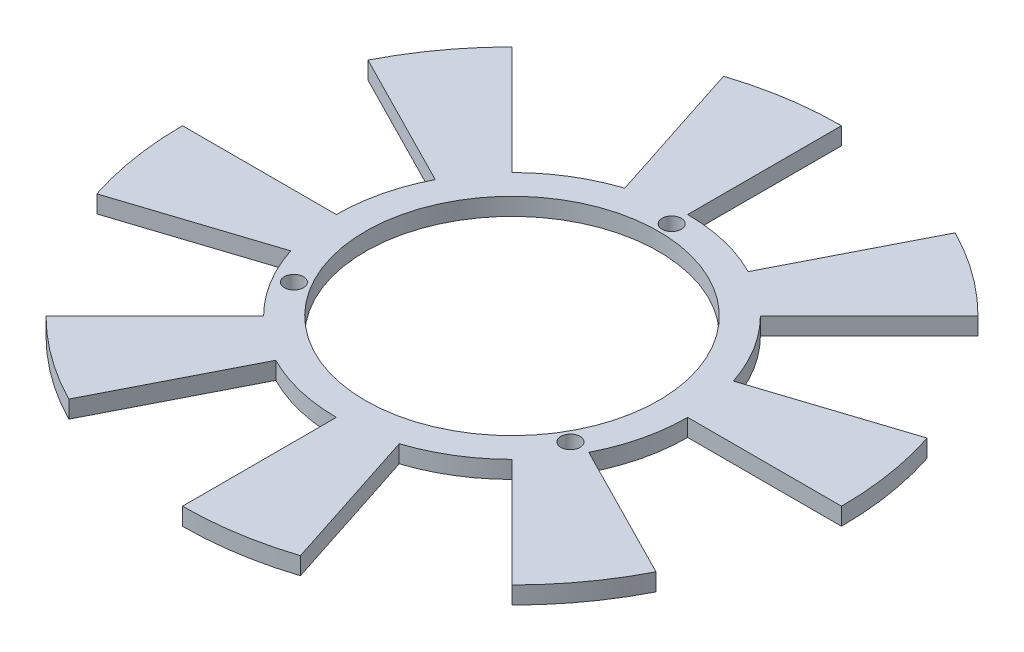
ISO-10303-21;
HEADER;
FILE_DESCRIPTION(('STEP AP214'),'2;1');
FILE_NAME('part.step','',(''),(''),'','','');
FILE_SCHEMA(('AUTOMOTIVE_DESIGN { 1 0 10303 214 1 1 1 1 }'));
ENDSEC;
DATA;
#1=APPLICATION_CONTEXT('core data for automotive mechanical design processes');
#2=APPLICATION_PROTOCOL_DEFINITION('international standard','automotive_design',2000,#1);
#3=PRODUCT_CONTEXT('',#1,'mechanical');
#4=PRODUCT('Part','Part','',(#3));
#5=PRODUCT_RELATED_PRODUCT_CATEGORY('part','',(#4));
#6=PRODUCT_DEFINITION_FORMATION('','',#4);
#7=PRODUCT_DEFINITION_CONTEXT('part definition',#1,'design');
#8=PRODUCT_DEFINITION('design','',#6,#7);
#9=PRODUCT_DEFINITION_SHAPE('','',#8);
#10=(LENGTH_UNIT() NAMED_UNIT(*) SI_UNIT(.MILLI.,.METRE.));
#11=(NAMED_UNIT(*) PLANE_ANGLE_UNIT() SI_UNIT($,.RADIAN.));
#12=(NAMED_UNIT(*) SI_UNIT($,.STERADIAN.) SOLID_ANGLE_UNIT());
#13=UNCERTAINTY_MEASURE_WITH_UNIT(LENGTH_MEASURE(1.E-05),#10,'distance_accuracy_value','');
#14=(GEOMETRIC_REPRESENTATION_CONTEXT(3) GLOBAL_UNCERTAINTY_ASSIGNED_CONTEXT((#13)) GLOBAL_UNIT_ASSIGNED_CONTEXT((#10,
#11,#12)) REPRESENTATION_CONTEXT('',''));
#15=CARTESIAN_POINT('',(0.,0.,0.));
#16=DIRECTION('',(0.,0.,1.));
#17=DIRECTION('',(1.,0.,0.));
#18=AXIS2_PLACEMENT_3D('',#15,#16,#17);
#19=CARTESIAN_POINT('',(0.,-3.,0.));
#20=DIRECTION('',(0.,1.,0.));
#21=DIRECTION('',(0.,0.,1.));
#22=AXIS2_PLACEMENT_3D('',#19,#20,#21);
#23=CYLINDRICAL_SURFACE('',#22,30.25);
#24=DIRECTION('',(0.,-1.,0.));
#25=VECTOR('',#24,1.);
#26=CARTESIAN_POINT('',(-13.7332126171213,0.,26.9529473566981));
#27=LINE('',#26,#25);
#28=CARTESIAN_POINT('',(-13.7332126171213,0.,26.9529473566981));
#29=VERTEX_POINT('',#28);
#30=CARTESIAN_POINT('',(-13.7332126171213,-3.,26.9529473566981));
#31=VERTEX_POINT('',#30);
#32=EDGE_CURVE('E285',#29,#31,#27,.T.);
#33=ORIENTED_EDGE('',*,*,#32,.T.);
#34=CARTESIAN_POINT('',(0.,-3.,0.));
#35=DIRECTION('',(0.,1.,0.));
#36=DIRECTION('',(1.,0.,0.));
#37=AXIS2_PLACEMENT_3D('',#34,#35,#36);
#38=CIRCLE('',#37,30.25);
#39=CARTESIAN_POINT('',(0.,-3.,30.25));
#40=VERTEX_POINT('',#39);
#41=EDGE_CURVE('E50',#31,#40,#38,.T.);
#42=ORIENTED_EDGE('',*,*,#41,.T.);
#43=DIRECTION('',(0.,-1.,0.));
#44=VECTOR('',#43,1.);
#45=CARTESIAN_POINT('',(0.,0.,30.25));
#46=LINE('',#45,#44);
#47=CARTESIAN_POINT('',(0.,0.,30.25));
#48=VERTEX_POINT('',#47);
#49=EDGE_CURVE('E441',#48,#40,#46,.T.);
#50=ORIENTED_EDGE('',*,*,#49,.F.);
#51=CARTESIAN_POINT('',(0.,0.,0.));
#52=DIRECTION('',(0.,1.,0.));
#53=DIRECTION('',(1.,0.,0.));
#54=AXIS2_PLACEMENT_3D('',#51,#52,#53);
#55=CIRCLE('',#54,30.25);
#56=EDGE_CURVE('E540',#29,#48,#55,.T.);
#57=ORIENTED_EDGE('',*,*,#56,.F.);
#58=EDGE_LOOP('',(#33,#42,#50,#57));
#59=FACE_BOUND('',#58,.T.);
#60=ADVANCED_FACE('F40',(#59),#23,.T.);
#61=DIRECTION('',(0.,-1.,0.));
#62=VECTOR('',#61,1.);
#63=CARTESIAN_POINT('',(-21.3899801308925,0.,21.3899801308936));
#64=LINE('',#63,#62);
#65=CARTESIAN_POINT('',(-21.3899801308925,0.,21.3899801308936));
#66=VERTEX_POINT('',#65);
#67=CARTESIAN_POINT('',(-21.3899801308925,-3.,21.3899801308936));
#68=VERTEX_POINT('',#67);
#69=EDGE_CURVE('E264',#66,#68,#64,.T.);
#70=ORIENTED_EDGE('',*,*,#69,.F.);
#71=CARTESIAN_POINT('',(-28.7694596179284,0.,9.34776407984219));
#72=VERTEX_POINT('',#71);
#73=EDGE_CURVE('E270',#72,#66,#55,.T.);
#74=ORIENTED_EDGE('',*,*,#73,.F.);
#75=DIRECTION('',(0.,-1.,0.));
#76=VECTOR('',#75,1.);
#77=CARTESIAN_POINT('',(-28.7694596179284,0.,9.34776407984219));
#78=LINE('',#77,#76);
#79=CARTESIAN_POINT('',(-28.7694596179284,-3.,9.34776407984219));
#80=VERTEX_POINT('',#79);
#81=EDGE_CURVE('E307',#72,#80,#78,.T.);
#82=ORIENTED_EDGE('',*,*,#81,.T.);
#83=EDGE_CURVE('E611',#80,#68,#38,.T.);
#84=ORIENTED_EDGE('',*,*,#83,.T.);
#85=EDGE_LOOP('',(#70,#74,#82,#84));
#86=FACE_BOUND('',#85,.T.);
#87=ADVANCED_FACE('F515',(#86),#23,.T.);
#88=DIRECTION('',(0.,-1.,0.));
#89=VECTOR('',#88,1.);
#90=CARTESIAN_POINT('',(-30.25,0.,7.49400541621981E-13));
#91=LINE('',#90,#89);
#92=CARTESIAN_POINT('',(-30.25,0.,7.49400541621981E-13));
#93=VERTEX_POINT('',#92);
#94=CARTESIAN_POINT('',(-30.25,-3.,7.49400541621981E-13));
#95=VERTEX_POINT('',#94);
#96=EDGE_CURVE('E310',#93,#95,#91,.T.);
#97=ORIENTED_EDGE('',*,*,#96,.F.);
#98=CARTESIAN_POINT('',(-26.9529473566981,0.,-13.7332126171213));
#99=VERTEX_POINT('',#98);
#100=EDGE_CURVE('E588',#99,#93,#55,.T.);
#101=ORIENTED_EDGE('',*,*,#100,.F.);
#102=DIRECTION('',(0.,-1.,0.));
#103=VECTOR('',#102,1.);
#104=CARTESIAN_POINT('',(-26.9529473566981,0.,-13.7332126171213));
#105=LINE('',#104,#103);
#106=CARTESIAN_POINT('',(-26.9529473566981,-3.,-13.7332126171213));
#107=VERTEX_POINT('',#106);
#108=EDGE_CURVE('E333',#99,#107,#105,.T.);
#109=ORIENTED_EDGE('',*,*,#108,.T.);
#110=EDGE_CURVE('E600',#107,#95,#38,.T.);
#111=ORIENTED_EDGE('',*,*,#110,.T.);
#112=EDGE_LOOP('',(#97,#101,#109,#111));
#113=FACE_BOUND('',#112,.T.);
#114=ADVANCED_FACE('F520',(#113),#23,.T.);
#115=DIRECTION('',(0.,-1.,0.));
#116=VECTOR('',#115,1.);
#117=CARTESIAN_POINT('',(-21.3899801308936,0.,-21.3899801308926));
#118=LINE('',#117,#116);
#119=CARTESIAN_POINT('',(-21.3899801308936,0.,-21.3899801308926));
#120=VERTEX_POINT('',#119);
#121=CARTESIAN_POINT('',(-21.3899801308936,-3.,-21.3899801308926));
#122=VERTEX_POINT('',#121);
#123=EDGE_CURVE('E336',#120,#122,#118,.T.);
#124=ORIENTED_EDGE('',*,*,#123,.F.);
#125=CARTESIAN_POINT('',(-9.34776407984219,0.,-28.7694596179284));
#126=VERTEX_POINT('',#125);
#127=EDGE_CURVE('E586',#126,#120,#55,.T.);
#128=ORIENTED_EDGE('',*,*,#127,.F.);
#129=DIRECTION('',(0.,-1.,0.));
#130=VECTOR('',#129,1.);
#131=CARTESIAN_POINT('',(-9.34776407984219,0.,-28.7694596179284));
#132=LINE('',#131,#130);
#133=CARTESIAN_POINT('',(-9.34776407984219,-3.,-28.7694596179284));
#134=VERTEX_POINT('',#133);
#135=EDGE_CURVE('E359',#126,#134,#132,.T.);
#136=ORIENTED_EDGE('',*,*,#135,.T.);
#137=EDGE_CURVE('E864',#134,#122,#38,.T.);
#138=ORIENTED_EDGE('',*,*,#137,.T.);
#139=EDGE_LOOP('',(#124,#128,#136,#138));
#140=FACE_BOUND('',#139,.T.);
#141=ADVANCED_FACE('F863',(#140),#23,.T.);
#142=DIRECTION('',(0.,-1.,0.));
#143=VECTOR('',#142,1.);
#144=CARTESIAN_POINT('',(-6.27102536565616E-13,0.,-30.25));
#145=LINE('',#144,#143);
#146=CARTESIAN_POINT('',(-6.27102536565616E-13,0.,-30.25));
#147=VERTEX_POINT('',#146);
#148=CARTESIAN_POINT('',(-6.27102536565616E-13,-3.,-30.25));
#149=VERTEX_POINT('',#148);
#150=EDGE_CURVE('E362',#147,#149,#145,.T.);
#151=ORIENTED_EDGE('',*,*,#150,.F.);
#152=CARTESIAN_POINT('',(13.7332126171213,0.,-26.9529473566981));
#153=VERTEX_POINT('',#152);
#154=EDGE_CURVE('E542',#153,#147,#55,.T.);
#155=ORIENTED_EDGE('',*,*,#154,.F.);
#156=DIRECTION('',(0.,-1.,0.));
#157=VECTOR('',#156,1.);
#158=CARTESIAN_POINT('',(13.7332126171213,0.,-26.9529473566981));
#159=LINE('',#158,#157);
#160=CARTESIAN_POINT('',(13.7332126171213,-3.,-26.9529473566981));
#161=VERTEX_POINT('',#160);
#162=EDGE_CURVE('E385',#153,#161,#159,.T.);
#163=ORIENTED_EDGE('',*,*,#162,.T.);
#164=EDGE_CURVE('E866',#161,#149,#38,.T.);
#165=ORIENTED_EDGE('',*,*,#164,.T.);
#166=EDGE_LOOP('',(#151,#155,#163,#165));
#167=FACE_BOUND('',#166,.T.);
#168=ADVANCED_FACE('F871',(#167),#23,.T.);
#169=DIRECTION('',(0.,-1.,0.));
#170=VECTOR('',#169,1.);
#171=CARTESIAN_POINT('',(21.3899801308927,0.,-21.3899801308935));
#172=LINE('',#171,#170);
#173=CARTESIAN_POINT('',(21.3899801308927,0.,-21.3899801308935));
#174=VERTEX_POINT('',#173);
#175=CARTESIAN_POINT('',(21.3899801308927,-3.,-21.3899801308935));
#176=VERTEX_POINT('',#175);
#177=EDGE_CURVE('E388',#174,#176,#172,.T.);
#178=ORIENTED_EDGE('',*,*,#177,.F.);
#179=CARTESIAN_POINT('',(28.7694596179284,0.,-9.34776407984219));
#180=VERTEX_POINT('',#179);
#181=EDGE_CURVE('E539',#180,#174,#55,.T.);
#182=ORIENTED_EDGE('',*,*,#181,.F.);
#183=DIRECTION('',(0.,-1.,0.));
#184=VECTOR('',#183,1.);
#185=CARTESIAN_POINT('',(28.7694596179284,0.,-9.34776407984219));
#186=LINE('',#185,#184);
#187=CARTESIAN_POINT('',(28.7694596179284,-3.,-9.34776407984219));
#188=VERTEX_POINT('',#187);
#189=EDGE_CURVE('E411',#180,#188,#186,.T.);
#190=ORIENTED_EDGE('',*,*,#189,.T.);
#191=EDGE_CURVE('E49',#188,#176,#38,.T.);
#192=ORIENTED_EDGE('',*,*,#191,.T.);
#193=EDGE_LOOP('',(#178,#182,#190,#192));
#194=FACE_BOUND('',#193,.T.);
#195=ADVANCED_FACE('F528',(#194),#23,.T.);
#196=DIRECTION('',(0.,-1.,0.));
#197=VECTOR('',#196,1.);
#198=CARTESIAN_POINT('',(9.34776407984219,0.,28.7694596179284));
#199=LINE('',#198,#197);
#200=CARTESIAN_POINT('',(9.34776407984219,0.,28.7694596179284));
#201=VERTEX_POINT('',#200);
#202=CARTESIAN_POINT('',(9.34776407984219,-3.,28.7694596179284));
#203=VERTEX_POINT('',#202);
#204=EDGE_CURVE('E438',#201,#203,#199,.T.);
#205=ORIENTED_EDGE('',*,*,#204,.T.);
#206=CARTESIAN_POINT('',(21.3899801308934,-3.,21.3899801308927));
#207=VERTEX_POINT('',#206);
#208=EDGE_CURVE('E51',#203,#207,#38,.T.);
#209=ORIENTED_EDGE('',*,*,#208,.T.);
#210=DIRECTION('',(0.,-1.,0.));
#211=VECTOR('',#210,1.);
#212=CARTESIAN_POINT('',(21.3899801308934,0.,21.3899801308927));
#213=LINE('',#212,#211);
#214=CARTESIAN_POINT('',(21.3899801308934,0.,21.3899801308927));
#215=VERTEX_POINT('',#214);
#216=EDGE_CURVE('E469',#215,#207,#213,.T.);
#217=ORIENTED_EDGE('',*,*,#216,.F.);
#218=EDGE_CURVE('E494',#201,#215,#55,.T.);
#219=ORIENTED_EDGE('',*,*,#218,.F.);
#220=EDGE_LOOP('',(#205,#209,#217,#219));
#221=FACE_BOUND('',#220,.T.);
#222=ADVANCED_FACE('F523',(#221),#23,.T.);
#223=DIRECTION('',(0.,-1.,0.));
#224=VECTOR('',#223,1.);
#225=CARTESIAN_POINT('',(30.25,0.,-5.29090660172926E-13));
#226=LINE('',#225,#224);
#227=CARTESIAN_POINT('',(30.25,0.,-5.29090660172926E-13));
#228=VERTEX_POINT('',#227);
#229=CARTESIAN_POINT('',(30.25,-3.,-5.29090660172926E-13));
#230=VERTEX_POINT('',#229);
#231=EDGE_CURVE('E414',#228,#230,#226,.T.);
#232=ORIENTED_EDGE('',*,*,#231,.F.);
#233=CARTESIAN_POINT('',(26.9529473566981,0.,13.7332126171213));
#234=VERTEX_POINT('',#233);
#235=EDGE_CURVE('E44',#234,#228,#55,.T.);
#236=ORIENTED_EDGE('',*,*,#235,.F.);
#237=DIRECTION('',(0.,-1.,0.));
#238=VECTOR('',#237,1.);
#239=CARTESIAN_POINT('',(26.9529473566981,0.,13.7332126171213));
#240=LINE('',#239,#238);
#241=CARTESIAN_POINT('',(26.9529473566981,-3.,13.7332126171213));
#242=VERTEX_POINT('',#241);
#243=EDGE_CURVE('E466',#234,#242,#240,.T.);
#244=ORIENTED_EDGE('',*,*,#243,.T.);
#245=EDGE_CURVE('E12',#242,#230,#38,.T.);
#246=ORIENTED_EDGE('',*,*,#245,.T.);
#247=EDGE_LOOP('',(#232,#236,#244,#246));
#248=FACE_BOUND('',#247,.T.);
#249=ADVANCED_FACE('F42',(#248),#23,.T.);
#250=CARTESIAN_POINT('',(0.,-3.,0.));
#251=DIRECTION('',(0.,1.,0.));
#252=DIRECTION('',(0.,0.,1.));
#253=AXIS2_PLACEMENT_3D('',#250,#251,#252);
#254=PLANE('',#253);
#255=CARTESIAN_POINT('',(0.,-3.,-27.5));
#256=DIRECTION('',(0.,1.,0.));
#257=DIRECTION('',(0.,0.,1.));
#258=AXIS2_PLACEMENT_3D('',#255,#256,#257);
#259=CIRCLE('',#258,1.65);
#260=CARTESIAN_POINT('',(0.,-3.,-25.85));
#261=VERTEX_POINT('',#260);
#262=EDGE_CURVE('E487',#261,#261,#259,.T.);
#263=ORIENTED_EDGE('',*,*,#262,.T.);
#264=EDGE_LOOP('',(#263));
#265=FACE_BOUND('',#264,.T.);
#266=CARTESIAN_POINT('',(23.815698604072,-3.,13.7500000000001));
#267=DIRECTION('',(0.,1.,0.));
#268=DIRECTION('',(0.,0.,1.));
#269=AXIS2_PLACEMENT_3D('',#266,#267,#268);
#270=CIRCLE('',#269,1.65);
#271=CARTESIAN_POINT('',(23.815698604072,-3.,15.4000000000001));
#272=VERTEX_POINT('',#271);
#273=EDGE_CURVE('E484',#272,#272,#270,.T.);
#274=ORIENTED_EDGE('',*,*,#273,.T.);
#275=EDGE_LOOP('',(#274));
#276=FACE_BOUND('',#275,.T.);
#277=CARTESIAN_POINT('',(-23.815698604072,-3.,13.7500000000001));
#278=DIRECTION('',(0.,1.,0.));
#279=DIRECTION('',(0.,0.,1.));
#280=AXIS2_PLACEMENT_3D('',#277,#278,#279);
#281=CIRCLE('',#280,1.65);
#282=CARTESIAN_POINT('',(-23.815698604072,-3.,15.4000000000001));
#283=VERTEX_POINT('',#282);
#284=EDGE_CURVE('E476',#283,#283,#281,.T.);
#285=ORIENTED_EDGE('',*,*,#284,.T.);
#286=EDGE_LOOP('',(#285));
#287=FACE_BOUND('',#286,.T.);
#288=CARTESIAN_POINT('',(0.,-3.,0.));
#289=DIRECTION('',(0.,1.,0.));
#290=DIRECTION('',(0.,0.,1.));
#291=AXIS2_PLACEMENT_3D('',#288,#289,#290);
#292=CIRCLE('',#291,25.25);
#293=CARTESIAN_POINT('',(0.,-3.,25.25));
#294=VERTEX_POINT('',#293);
#295=EDGE_CURVE('E491',#294,#294,#292,.T.);
#296=ORIENTED_EDGE('',*,*,#295,.T.);
#297=EDGE_LOOP('',(#296));
#298=FACE_BOUND('',#297,.T.);
#299=ORIENTED_EDGE('',*,*,#245,.F.);
#300=DIRECTION('',(0.891006524188368,0.,0.453990499739546));
#301=VECTOR('',#300,1.);
#302=CARTESIAN_POINT('',(26.9529473566981,-3.,13.7332126171213));
#303=LINE('',#302,#301);
#304=CARTESIAN_POINT('',(50.5646202476899,-3.,25.7639608602192));
#305=VERTEX_POINT('',#304);
#306=EDGE_CURVE('E449',#242,#305,#303,.T.);
#307=ORIENTED_EDGE('',*,*,#306,.T.);
#308=CARTESIAN_POINT('',(0.,-3.,0.));
#309=DIRECTION('',(0.,-1.,0.));
#310=DIRECTION('',(0.,0.,-1.));
#311=AXIS2_PLACEMENT_3D('',#308,#309,#310);
#312=CIRCLE('',#311,56.75);
#313=CARTESIAN_POINT('',(40.1283098323372,-3.,40.1283098323359));
#314=VERTEX_POINT('',#313);
#315=EDGE_CURVE('E437',#305,#314,#312,.T.);
#316=ORIENTED_EDGE('',*,*,#315,.T.);
#317=DIRECTION('',(-0.707106781186559,0.,-0.707106781186536));
#318=VECTOR('',#317,1.);
#319=CARTESIAN_POINT('',(40.1283098323372,-3.,40.1283098323359));
#320=LINE('',#319,#318);
#321=EDGE_CURVE('E458',#314,#207,#320,.T.);
#322=ORIENTED_EDGE('',*,*,#321,.T.);
#323=ORIENTED_EDGE('',*,*,#208,.F.);
#324=DIRECTION('',(0.309016994374948,0.,0.951056516295154));
#325=VECTOR('',#324,1.);
#326=CARTESIAN_POINT('',(9.34776407984219,-3.,28.7694596179284));
#327=LINE('',#326,#325);
#328=CARTESIAN_POINT('',(17.5367144307783,-3.,53.97245729975));
#329=VERTEX_POINT('',#328);
#330=EDGE_CURVE('E421',#203,#329,#327,.T.);
#331=ORIENTED_EDGE('',*,*,#330,.T.);
#332=CARTESIAN_POINT('',(0.,-3.,0.));
#333=DIRECTION('',(0.,-1.,0.));
#334=DIRECTION('',(0.,0.,-1.));
#335=AXIS2_PLACEMENT_3D('',#332,#333,#334);
#336=CIRCLE('',#335,56.75);
#337=CARTESIAN_POINT('',(0.,-3.,56.75));
#338=VERTEX_POINT('',#337);
#339=EDGE_CURVE('E410',#329,#338,#336,.T.);
#340=ORIENTED_EDGE('',*,*,#339,.T.);
#341=DIRECTION('',(0.,0.,-1.));
#342=VECTOR('',#341,1.);
#343=CARTESIAN_POINT('',(0.,-3.,56.75));
#344=LINE('',#343,#342);
#345=EDGE_CURVE('E430',#338,#40,#344,.T.);
#346=ORIENTED_EDGE('',*,*,#345,.T.);
#347=ORIENTED_EDGE('',*,*,#41,.F.);
#348=DIRECTION('',(-0.453990499739546,0.,0.891006524188368));
#349=VECTOR('',#348,1.);
#350=CARTESIAN_POINT('',(-13.7332126171213,-3.,26.9529473566981));
#351=LINE('',#350,#349);
#352=CARTESIAN_POINT('',(-25.7639608602193,-3.,50.5646202476899));
#353=VERTEX_POINT('',#352);
#354=EDGE_CURVE('E274',#31,#353,#351,.T.);
#355=ORIENTED_EDGE('',*,*,#354,.T.);
#356=CARTESIAN_POINT('',(0.,-3.,0.));
#357=DIRECTION('',(0.,-1.,0.));
#358=DIRECTION('',(0.,0.,-1.));
#359=AXIS2_PLACEMENT_3D('',#356,#357,#358);
#360=CIRCLE('',#359,56.75);
#361=CARTESIAN_POINT('',(-40.1283098323366,-3.,40.1283098323366));
#362=VERTEX_POINT('',#361);
#363=EDGE_CURVE('E280',#353,#362,#360,.T.);
#364=ORIENTED_EDGE('',*,*,#363,.T.);
#365=DIRECTION('',(0.707106781186569,0.,-0.707106781186526));
#366=VECTOR('',#365,1.);
#367=CARTESIAN_POINT('',(-40.1283098323366,-3.,40.1283098323366));
#368=LINE('',#367,#366);
#369=EDGE_CURVE('E259',#362,#68,#368,.T.);
#370=ORIENTED_EDGE('',*,*,#369,.T.);
#371=ORIENTED_EDGE('',*,*,#83,.F.);
#372=DIRECTION('',(-0.951056516295154,0.,0.309016994374948));
#373=VECTOR('',#372,1.);
#374=CARTESIAN_POINT('',(-28.7694596179284,-3.,9.34776407984218));
#375=LINE('',#374,#373);
#376=CARTESIAN_POINT('',(-53.97245729975,-3.,17.5367144307783));
#377=VERTEX_POINT('',#376);
#378=EDGE_CURVE('E293',#80,#377,#375,.T.);
#379=ORIENTED_EDGE('',*,*,#378,.T.);
#380=CARTESIAN_POINT('',(0.,-3.,0.));
#381=DIRECTION('',(0.,-1.,0.));
#382=DIRECTION('',(0.,0.,-1.));
#383=AXIS2_PLACEMENT_3D('',#380,#381,#382);
#384=CIRCLE('',#383,56.75);
#385=CARTESIAN_POINT('',(-56.75,-3.,0.));
#386=VERTEX_POINT('',#385);
#387=EDGE_CURVE('E284',#377,#386,#384,.T.);
#388=ORIENTED_EDGE('',*,*,#387,.T.);
#389=DIRECTION('',(1.,0.,0.));
#390=VECTOR('',#389,1.);
#391=CARTESIAN_POINT('',(-56.75,-3.,0.));
#392=LINE('',#391,#390);
#393=EDGE_CURVE('E299',#386,#95,#392,.T.);
#394=ORIENTED_EDGE('',*,*,#393,.T.);
#395=ORIENTED_EDGE('',*,*,#110,.F.);
#396=DIRECTION('',(-0.891006524188368,0.,-0.453990499739546));
#397=VECTOR('',#396,1.);
#398=CARTESIAN_POINT('',(-26.9529473566981,-3.,-13.7332126171213));
#399=LINE('',#398,#397);
#400=CARTESIAN_POINT('',(-50.5646202476899,-3.,-25.7639608602192));
#401=VERTEX_POINT('',#400);
#402=EDGE_CURVE('E317',#107,#401,#399,.T.);
#403=ORIENTED_EDGE('',*,*,#402,.T.);
#404=CARTESIAN_POINT('',(0.,-3.,0.));
#405=DIRECTION('',(0.,-1.,0.));
#406=DIRECTION('',(0.,0.,-1.));
#407=AXIS2_PLACEMENT_3D('',#404,#405,#406);
#408=CIRCLE('',#407,56.75);
#409=CARTESIAN_POINT('',(-40.1283098323366,-3.,-40.1283098323366));
#410=VERTEX_POINT('',#409);
#411=EDGE_CURVE('E306',#401,#410,#408,.T.);
#412=ORIENTED_EDGE('',*,*,#411,.T.);
#413=DIRECTION('',(0.707106781186529,0.,0.707106781186566));
#414=VECTOR('',#413,1.);
#415=CARTESIAN_POINT('',(-40.1283098323366,-3.,-40.1283098323366));
#416=LINE('',#415,#414);
#417=EDGE_CURVE('E325',#410,#122,#416,.T.);
#418=ORIENTED_EDGE('',*,*,#417,.T.);
#419=ORIENTED_EDGE('',*,*,#137,.F.);
#420=DIRECTION('',(-0.309016994374948,0.,-0.951056516295154));
#421=VECTOR('',#420,1.);
#422=CARTESIAN_POINT('',(-9.34776407984218,-3.,-28.7694596179284));
#423=LINE('',#422,#421);
#424=CARTESIAN_POINT('',(-17.5367144307783,-3.,-53.97245729975));
#425=VERTEX_POINT('',#424);
#426=EDGE_CURVE('E343',#134,#425,#423,.T.);
#427=ORIENTED_EDGE('',*,*,#426,.T.);
#428=CARTESIAN_POINT('',(0.,-3.,0.));
#429=DIRECTION('',(0.,-1.,0.));
#430=DIRECTION('',(0.,0.,-1.));
#431=AXIS2_PLACEMENT_3D('',#428,#429,#430);
#432=CIRCLE('',#431,56.75);
#433=CARTESIAN_POINT('',(-1.17787724018825E-12,-3.,-56.75));
#434=VERTEX_POINT('',#433);
#435=EDGE_CURVE('E332',#425,#434,#432,.T.);
#436=ORIENTED_EDGE('',*,*,#435,.T.);
#437=DIRECTION('',(0.,0.,1.));
#438=VECTOR('',#437,1.);
#439=CARTESIAN_POINT('',(-1.17787724018825E-12,-3.,-56.75));
#440=LINE('',#439,#438);
#441=EDGE_CURVE('E351',#434,#149,#440,.T.);
#442=ORIENTED_EDGE('',*,*,#441,.T.);
#443=ORIENTED_EDGE('',*,*,#164,.F.);
#444=DIRECTION('',(0.453990499739546,0.,-0.891006524188368));
#445=VECTOR('',#444,1.);
#446=CARTESIAN_POINT('',(13.7332126171213,-3.,-26.9529473566981));
#447=LINE('',#446,#445);
#448=CARTESIAN_POINT('',(25.7639608602192,-3.,-50.5646202476899));
#449=VERTEX_POINT('',#448);
#450=EDGE_CURVE('E369',#161,#449,#447,.T.);
#451=ORIENTED_EDGE('',*,*,#450,.T.);
#452=CARTESIAN_POINT('',(0.,-3.,0.));
#453=DIRECTION('',(0.,-1.,0.));
#454=DIRECTION('',(0.,0.,-1.));
#455=AXIS2_PLACEMENT_3D('',#452,#453,#454);
#456=CIRCLE('',#455,56.75);
#457=CARTESIAN_POINT('',(40.1283098323358,-3.,-40.1283098323374));
#458=VERTEX_POINT('',#457);
#459=EDGE_CURVE('E358',#449,#458,#456,.T.);
#460=ORIENTED_EDGE('',*,*,#459,.T.);
#461=DIRECTION('',(-0.707106781186534,0.,0.707106781186561));
#462=VECTOR('',#461,1.);
#463=CARTESIAN_POINT('',(40.1283098323358,-3.,-40.1283098323374));
#464=LINE('',#463,#462);
#465=EDGE_CURVE('E377',#458,#176,#464,.T.);
#466=ORIENTED_EDGE('',*,*,#465,.T.);
#467=ORIENTED_EDGE('',*,*,#191,.F.);
#468=DIRECTION('',(0.951056516295154,0.,-0.309016994374948));
#469=VECTOR('',#468,1.);
#470=CARTESIAN_POINT('',(28.7694596179284,-3.,-9.34776407984219));
#471=LINE('',#470,#469);
#472=CARTESIAN_POINT('',(53.97245729975,-3.,-17.5367144307783));
#473=VERTEX_POINT('',#472);
#474=EDGE_CURVE('E395',#188,#473,#471,.T.);
#475=ORIENTED_EDGE('',*,*,#474,.T.);
#476=CARTESIAN_POINT('',(0.,-3.,0.));
#477=DIRECTION('',(0.,-1.,0.));
#478=DIRECTION('',(0.,0.,-1.));
#479=AXIS2_PLACEMENT_3D('',#476,#477,#478);
#480=CIRCLE('',#479,56.75);
#481=CARTESIAN_POINT('',(56.75,-3.,-9.8879238130678E-13));
#482=VERTEX_POINT('',#481);
#483=EDGE_CURVE('E384',#473,#482,#480,.T.);
#484=ORIENTED_EDGE('',*,*,#483,.T.);
#485=DIRECTION('',(-1.,0.,0.));
#486=VECTOR('',#485,1.);
#487=CARTESIAN_POINT('',(56.75,-3.,-9.8879238130678E-13));
#488=LINE('',#487,#486);
#489=EDGE_CURVE('E403',#482,#230,#488,.T.);
#490=ORIENTED_EDGE('',*,*,#489,.T.);
#491=EDGE_LOOP('',(#299,#307,#316,#322,#323,#331,#340,#346,#347,#355,#364,#370,#371,#379,#388,
#394,#395,#403,#412,#418,#419,#427,#436,#442,#443,#451,#460,#466,#467,#475,#484,#490));
#492=FACE_BOUND('',#491,.T.);
#493=ADVANCED_FACE('F501',(#265,#276,#287,#298,#492),#254,.F.);
#494=CARTESIAN_POINT('',(0.,0.,0.));
#495=DIRECTION('',(0.,1.,0.));
#496=DIRECTION('',(0.,0.,1.));
#497=AXIS2_PLACEMENT_3D('',#494,#495,#496);
#498=PLANE('',#497);
#499=CARTESIAN_POINT('',(0.,0.,-27.5));
#500=DIRECTION('',(0.,1.,0.));
#501=DIRECTION('',(0.,0.,1.));
#502=AXIS2_PLACEMENT_3D('',#499,#500,#501);
#503=CIRCLE('',#502,1.65);
#504=CARTESIAN_POINT('',(0.,0.,-25.85));
#505=VERTEX_POINT('',#504);
#506=EDGE_CURVE('E473',#505,#505,#503,.T.);
#507=ORIENTED_EDGE('',*,*,#506,.F.);
#508=EDGE_LOOP('',(#507));
#509=FACE_BOUND('',#508,.T.);
#510=CARTESIAN_POINT('',(23.815698604072,0.,13.7500000000001));
#511=DIRECTION('',(0.,1.,0.));
#512=DIRECTION('',(0.,0.,1.));
#513=AXIS2_PLACEMENT_3D('',#510,#511,#512);
#514=CIRCLE('',#513,1.65);
#515=CARTESIAN_POINT('',(23.815698604072,0.,15.4000000000001));
#516=VERTEX_POINT('',#515);
#517=EDGE_CURVE('E477',#516,#516,#514,.T.);
#518=ORIENTED_EDGE('',*,*,#517,.F.);
#519=EDGE_LOOP('',(#518));
#520=FACE_BOUND('',#519,.T.);
#521=CARTESIAN_POINT('',(-23.815698604072,0.,13.7500000000001));
#522=DIRECTION('',(0.,1.,0.));
#523=DIRECTION('',(0.,0.,1.));
#524=AXIS2_PLACEMENT_3D('',#521,#522,#523);
#525=CIRCLE('',#524,1.65);
#526=CARTESIAN_POINT('',(-23.815698604072,0.,15.4000000000001));
#527=VERTEX_POINT('',#526);
#528=EDGE_CURVE('E465',#527,#527,#525,.T.);
#529=ORIENTED_EDGE('',*,*,#528,.F.);
#530=EDGE_LOOP('',(#529));
#531=FACE_BOUND('',#530,.T.);
#532=CARTESIAN_POINT('',(0.,0.,0.));
#533=DIRECTION('',(0.,1.,0.));
#534=DIRECTION('',(0.,0.,1.));
#535=AXIS2_PLACEMENT_3D('',#532,#533,#534);
#536=CIRCLE('',#535,25.25);
#537=CARTESIAN_POINT('',(0.,0.,25.25));
#538=VERTEX_POINT('',#537);
#539=EDGE_CURVE('E490',#538,#538,#536,.T.);
#540=ORIENTED_EDGE('',*,*,#539,.F.);
#541=EDGE_LOOP('',(#540));
#542=FACE_BOUND('',#541,.T.);
#543=ORIENTED_EDGE('',*,*,#235,.T.);
#544=DIRECTION('',(-1.,0.,0.));
#545=VECTOR('',#544,1.);
#546=CARTESIAN_POINT('',(56.75,0.,-9.8879238130678E-13));
#547=LINE('',#546,#545);
#548=CARTESIAN_POINT('',(56.75,0.,-9.8879238130678E-13));
#549=VERTEX_POINT('',#548);
#550=EDGE_CURVE('E394',#549,#228,#547,.T.);
#551=ORIENTED_EDGE('',*,*,#550,.F.);
#552=CARTESIAN_POINT('',(0.,0.,0.));
#553=DIRECTION('',(0.,-1.,0.));
#554=DIRECTION('',(0.,0.,-1.));
#555=AXIS2_PLACEMENT_3D('',#552,#553,#554);
#556=CIRCLE('',#555,56.75);
#557=CARTESIAN_POINT('',(53.97245729975,0.,-17.5367144307783));
#558=VERTEX_POINT('',#557);
#559=EDGE_CURVE('E391',#558,#549,#556,.T.);
#560=ORIENTED_EDGE('',*,*,#559,.F.);
#561=DIRECTION('',(0.951056516295154,0.,-0.309016994374948));
#562=VECTOR('',#561,1.);
#563=CARTESIAN_POINT('',(28.7694596179284,0.,-9.34776407984219));
#564=LINE('',#563,#562);
#565=EDGE_CURVE('E397',#180,#558,#564,.T.);
#566=ORIENTED_EDGE('',*,*,#565,.F.);
#567=ORIENTED_EDGE('',*,*,#181,.T.);
#568=DIRECTION('',(-0.707106781186534,0.,0.707106781186561));
#569=VECTOR('',#568,1.);
#570=CARTESIAN_POINT('',(40.1283098323358,0.,-40.1283098323374));
#571=LINE('',#570,#569);
#572=CARTESIAN_POINT('',(40.1283098323358,0.,-40.1283098323374));
#573=VERTEX_POINT('',#572);
#574=EDGE_CURVE('E368',#573,#174,#571,.T.);
#575=ORIENTED_EDGE('',*,*,#574,.F.);
#576=CARTESIAN_POINT('',(0.,0.,0.));
#577=DIRECTION('',(0.,-1.,0.));
#578=DIRECTION('',(0.,0.,-1.));
#579=AXIS2_PLACEMENT_3D('',#576,#577,#578);
#580=CIRCLE('',#579,56.75);
#581=CARTESIAN_POINT('',(25.7639608602192,0.,-50.5646202476899));
#582=VERTEX_POINT('',#581);
#583=EDGE_CURVE('E365',#582,#573,#580,.T.);
#584=ORIENTED_EDGE('',*,*,#583,.F.);
#585=DIRECTION('',(0.453990499739546,0.,-0.891006524188368));
#586=VECTOR('',#585,1.);
#587=CARTESIAN_POINT('',(13.7332126171213,0.,-26.9529473566981));
#588=LINE('',#587,#586);
#589=EDGE_CURVE('E371',#153,#582,#588,.T.);
#590=ORIENTED_EDGE('',*,*,#589,.F.);
#591=ORIENTED_EDGE('',*,*,#154,.T.);
#592=DIRECTION('',(0.,0.,1.));
#593=VECTOR('',#592,1.);
#594=CARTESIAN_POINT('',(-1.17787724018825E-12,0.,-56.75));
#595=LINE('',#594,#593);
#596=CARTESIAN_POINT('',(-1.17787724018825E-12,0.,-56.75));
#597=VERTEX_POINT('',#596);
#598=EDGE_CURVE('E342',#597,#147,#595,.T.);
#599=ORIENTED_EDGE('',*,*,#598,.F.);
#600=CARTESIAN_POINT('',(0.,0.,0.));
#601=DIRECTION('',(0.,-1.,0.));
#602=DIRECTION('',(0.,0.,-1.));
#603=AXIS2_PLACEMENT_3D('',#600,#601,#602);
#604=CIRCLE('',#603,56.75);
#605=CARTESIAN_POINT('',(-17.5367144307783,0.,-53.97245729975));
#606=VERTEX_POINT('',#605);
#607=EDGE_CURVE('E339',#606,#597,#604,.T.);
#608=ORIENTED_EDGE('',*,*,#607,.F.);
#609=DIRECTION('',(-0.309016994374948,0.,-0.951056516295154));
#610=VECTOR('',#609,1.);
#611=CARTESIAN_POINT('',(-9.34776407984218,0.,-28.7694596179284));
#612=LINE('',#611,#610);
#613=EDGE_CURVE('E345',#126,#606,#612,.T.);
#614=ORIENTED_EDGE('',*,*,#613,.F.);
#615=ORIENTED_EDGE('',*,*,#127,.T.);
#616=DIRECTION('',(0.707106781186529,0.,0.707106781186566));
#617=VECTOR('',#616,1.);
#618=CARTESIAN_POINT('',(-40.1283098323366,0.,-40.1283098323366));
#619=LINE('',#618,#617);
#620=CARTESIAN_POINT('',(-40.1283098323366,0.,-40.1283098323366));
#621=VERTEX_POINT('',#620);
#622=EDGE_CURVE('E316',#621,#120,#619,.T.);
#623=ORIENTED_EDGE('',*,*,#622,.F.);
#624=CARTESIAN_POINT('',(0.,0.,0.));
#625=DIRECTION('',(0.,-1.,0.));
#626=DIRECTION('',(0.,0.,-1.));
#627=AXIS2_PLACEMENT_3D('',#624,#625,#626);
#628=CIRCLE('',#627,56.75);
#629=CARTESIAN_POINT('',(-50.5646202476899,0.,-25.7639608602192));
#630=VERTEX_POINT('',#629);
#631=EDGE_CURVE('E313',#630,#621,#628,.T.);
#632=ORIENTED_EDGE('',*,*,#631,.F.);
#633=DIRECTION('',(-0.891006524188368,0.,-0.453990499739546));
#634=VECTOR('',#633,1.);
#635=CARTESIAN_POINT('',(-26.9529473566981,0.,-13.7332126171213));
#636=LINE('',#635,#634);
#637=EDGE_CURVE('E319',#99,#630,#636,.T.);
#638=ORIENTED_EDGE('',*,*,#637,.F.);
#639=ORIENTED_EDGE('',*,*,#100,.T.);
#640=DIRECTION('',(1.,0.,0.));
#641=VECTOR('',#640,1.);
#642=CARTESIAN_POINT('',(-56.75,0.,0.));
#643=LINE('',#642,#641);
#644=CARTESIAN_POINT('',(-56.75,0.,0.));
#645=VERTEX_POINT('',#644);
#646=EDGE_CURVE('E292',#645,#93,#643,.T.);
#647=ORIENTED_EDGE('',*,*,#646,.F.);
#648=CARTESIAN_POINT('',(0.,0.,0.));
#649=DIRECTION('',(0.,-1.,0.));
#650=DIRECTION('',(0.,0.,-1.));
#651=AXIS2_PLACEMENT_3D('',#648,#649,#650);
#652=CIRCLE('',#651,56.75);
#653=CARTESIAN_POINT('',(-53.97245729975,0.,17.5367144307783));
#654=VERTEX_POINT('',#653);
#655=EDGE_CURVE('E289',#654,#645,#652,.T.);
#656=ORIENTED_EDGE('',*,*,#655,.F.);
#657=DIRECTION('',(-0.951056516295154,0.,0.309016994374948));
#658=VECTOR('',#657,1.);
#659=CARTESIAN_POINT('',(-28.7694596179284,0.,9.34776407984218));
#660=LINE('',#659,#658);
#661=EDGE_CURVE('E65',#72,#654,#660,.T.);
#662=ORIENTED_EDGE('',*,*,#661,.F.);
#663=ORIENTED_EDGE('',*,*,#73,.T.);
#664=DIRECTION('',(0.707106781186569,0.,-0.707106781186526));
#665=VECTOR('',#664,1.);
#666=CARTESIAN_POINT('',(-40.1283098323366,0.,40.1283098323366));
#667=LINE('',#666,#665);
#668=CARTESIAN_POINT('',(-40.1283098323366,0.,40.1283098323366));
#669=VERTEX_POINT('',#668);
#670=EDGE_CURVE('E256',#669,#66,#667,.T.);
#671=ORIENTED_EDGE('',*,*,#670,.F.);
#672=CARTESIAN_POINT('',(0.,0.,0.));
#673=DIRECTION('',(0.,-1.,0.));
#674=DIRECTION('',(0.,0.,-1.));
#675=AXIS2_PLACEMENT_3D('',#672,#673,#674);
#676=CIRCLE('',#675,56.75);
#677=CARTESIAN_POINT('',(-25.7639608602193,0.,50.5646202476899));
#678=VERTEX_POINT('',#677);
#679=EDGE_CURVE('E268',#678,#669,#676,.T.);
#680=ORIENTED_EDGE('',*,*,#679,.F.);
#681=DIRECTION('',(-0.453990499739546,0.,0.891006524188368));
#682=VECTOR('',#681,1.);
#683=CARTESIAN_POINT('',(-13.7332126171213,0.,26.9529473566981));
#684=LINE('',#683,#682);
#685=EDGE_CURVE('E58',#29,#678,#684,.T.);
#686=ORIENTED_EDGE('',*,*,#685,.F.);
#687=ORIENTED_EDGE('',*,*,#56,.T.);
#688=DIRECTION('',(0.,0.,-1.));
#689=VECTOR('',#688,1.);
#690=CARTESIAN_POINT('',(0.,0.,56.75));
#691=LINE('',#690,#689);
#692=CARTESIAN_POINT('',(0.,0.,56.75));
#693=VERTEX_POINT('',#692);
#694=EDGE_CURVE('E420',#693,#48,#691,.T.);
#695=ORIENTED_EDGE('',*,*,#694,.F.);
#696=CARTESIAN_POINT('',(0.,0.,0.));
#697=DIRECTION('',(0.,-1.,0.));
#698=DIRECTION('',(0.,0.,-1.));
#699=AXIS2_PLACEMENT_3D('',#696,#697,#698);
#700=CIRCLE('',#699,56.75);
#701=CARTESIAN_POINT('',(17.5367144307783,0.,53.97245729975));
#702=VERTEX_POINT('',#701);
#703=EDGE_CURVE('E417',#702,#693,#700,.T.);
#704=ORIENTED_EDGE('',*,*,#703,.F.);
#705=DIRECTION('',(0.309016994374948,0.,0.951056516295154));
#706=VECTOR('',#705,1.);
#707=CARTESIAN_POINT('',(9.34776407984219,0.,28.7694596179284));
#708=LINE('',#707,#706);
#709=EDGE_CURVE('E424',#201,#702,#708,.T.);
#710=ORIENTED_EDGE('',*,*,#709,.F.);
#711=ORIENTED_EDGE('',*,*,#218,.T.);
#712=DIRECTION('',(-0.707106781186559,0.,-0.707106781186536));
#713=VECTOR('',#712,1.);
#714=CARTESIAN_POINT('',(40.1283098323372,0.,40.1283098323359));
#715=LINE('',#714,#713);
#716=CARTESIAN_POINT('',(40.1283098323372,0.,40.1283098323359));
#717=VERTEX_POINT('',#716);
#718=EDGE_CURVE('E448',#717,#215,#715,.T.);
#719=ORIENTED_EDGE('',*,*,#718,.F.);
#720=CARTESIAN_POINT('',(0.,0.,0.));
#721=DIRECTION('',(0.,-1.,0.));
#722=DIRECTION('',(0.,0.,-1.));
#723=AXIS2_PLACEMENT_3D('',#720,#721,#722);
#724=CIRCLE('',#723,56.75);
#725=CARTESIAN_POINT('',(50.5646202476899,0.,25.7639608602192));
#726=VERTEX_POINT('',#725);
#727=EDGE_CURVE('E445',#726,#717,#724,.T.);
#728=ORIENTED_EDGE('',*,*,#727,.F.);
#729=DIRECTION('',(0.891006524188368,0.,0.453990499739546));
#730=VECTOR('',#729,1.);
#731=CARTESIAN_POINT('',(26.9529473566981,0.,13.7332126171213));
#732=LINE('',#731,#730);
#733=EDGE_CURVE('E452',#234,#726,#732,.T.);
#734=ORIENTED_EDGE('',*,*,#733,.F.);
#735=EDGE_LOOP('',(#543,#551,#560,#566,#567,#575,#584,#590,#591,#599,#608,#614,#615,#623,#632,
#638,#639,#647,#656,#662,#663,#671,#680,#686,#687,#695,#704,#710,#711,#719,#728,#734));
#736=FACE_BOUND('',#735,.T.);
#737=ADVANCED_FACE('F267',(#509,#520,#531,#542,#736),#498,.T.);
#738=CARTESIAN_POINT('',(0.,-3.,0.));
#739=DIRECTION('',(0.,1.,0.));
#740=DIRECTION('',(0.,0.,1.));
#741=AXIS2_PLACEMENT_3D('',#738,#739,#740);
#742=CYLINDRICAL_SURFACE('',#741,25.25);
#743=ORIENTED_EDGE('',*,*,#295,.F.);
#744=EDGE_LOOP('',(#743));
#745=FACE_BOUND('',#744,.T.);
#746=ORIENTED_EDGE('',*,*,#539,.T.);
#747=EDGE_LOOP('',(#746));
#748=FACE_BOUND('',#747,.T.);
#749=ADVANCED_FACE('F498',(#745,#748),#742,.F.);
#750=CARTESIAN_POINT('',(-23.815698604072,-10.,13.7500000000001));
#751=DIRECTION('',(0.,1.,0.));
#752=DIRECTION('',(0.,0.,1.));
#753=AXIS2_PLACEMENT_3D('',#750,#751,#752);
#754=CYLINDRICAL_SURFACE('',#753,1.65);
#755=ORIENTED_EDGE('',*,*,#528,.T.);
#756=EDGE_LOOP('',(#755));
#757=FACE_BOUND('',#756,.T.);
#758=ORIENTED_EDGE('',*,*,#284,.F.);
#759=EDGE_LOOP('',(#758));
#760=FACE_BOUND('',#759,.T.);
#761=ADVANCED_FACE('F507',(#757,#760),#754,.F.);
#762=CARTESIAN_POINT('',(23.815698604072,-10.,13.7500000000001));
#763=DIRECTION('',(0.,1.,0.));
#764=DIRECTION('',(0.,0.,1.));
#765=AXIS2_PLACEMENT_3D('',#762,#763,#764);
#766=CYLINDRICAL_SURFACE('',#765,1.65);
#767=ORIENTED_EDGE('',*,*,#517,.T.);
#768=EDGE_LOOP('',(#767));
#769=FACE_BOUND('',#768,.T.);
#770=ORIENTED_EDGE('',*,*,#273,.F.);
#771=EDGE_LOOP('',(#770));
#772=FACE_BOUND('',#771,.T.);
#773=ADVANCED_FACE('F646',(#769,#772),#766,.F.);
#774=CARTESIAN_POINT('',(0.,-10.,-27.5));
#775=DIRECTION('',(0.,1.,0.));
#776=DIRECTION('',(0.,0.,1.));
#777=AXIS2_PLACEMENT_3D('',#774,#775,#776);
#778=CYLINDRICAL_SURFACE('',#777,1.65);
#779=ORIENTED_EDGE('',*,*,#506,.T.);
#780=EDGE_LOOP('',(#779));
#781=FACE_BOUND('',#780,.T.);
#782=ORIENTED_EDGE('',*,*,#262,.F.);
#783=EDGE_LOOP('',(#782));
#784=FACE_BOUND('',#783,.T.);
#785=ADVANCED_FACE('F643',(#781,#784),#778,.F.);
#786=CARTESIAN_POINT('',(0.,0.,0.));
#787=DIRECTION('',(0.,-1.,0.));
#788=DIRECTION('',(0.,0.,-1.));
#789=AXIS2_PLACEMENT_3D('',#786,#787,#788);
#790=CYLINDRICAL_SURFACE('',#789,56.75);
#791=ORIENTED_EDGE('',*,*,#315,.F.);
#792=DIRECTION('',(0.,-1.,0.));
#793=VECTOR('',#792,1.);
#794=CARTESIAN_POINT('',(50.5646202476899,0.,25.7639608602192));
#795=LINE('',#794,#793);
#796=EDGE_CURVE('E463',#726,#305,#795,.T.);
#797=ORIENTED_EDGE('',*,*,#796,.F.);
#798=ORIENTED_EDGE('',*,*,#727,.T.);
#799=DIRECTION('',(0.,-1.,0.));
#800=VECTOR('',#799,1.);
#801=CARTESIAN_POINT('',(40.1283098323372,0.,40.1283098323359));
#802=LINE('',#801,#800);
#803=EDGE_CURVE('E455',#717,#314,#802,.T.);
#804=ORIENTED_EDGE('',*,*,#803,.T.);
#805=EDGE_LOOP('',(#791,#797,#798,#804));
#806=FACE_BOUND('',#805,.T.);
#807=ADVANCED_FACE('F555',(#806),#790,.T.);
#808=CARTESIAN_POINT('',(26.9529473566981,0.,13.7332126171213));
#809=DIRECTION('',(0.453990499739546,0.,-0.891006524188368));
#810=DIRECTION('',(-0.891006524188368,0.,-0.453990499739546));
#811=AXIS2_PLACEMENT_3D('',#808,#809,#810);
#812=PLANE('',#811);
#813=ORIENTED_EDGE('',*,*,#306,.F.);
#814=ORIENTED_EDGE('',*,*,#243,.F.);
#815=ORIENTED_EDGE('',*,*,#733,.T.);
#816=ORIENTED_EDGE('',*,*,#796,.T.);
#817=EDGE_LOOP('',(#813,#814,#815,#816));
#818=FACE_BOUND('',#817,.T.);
#819=ADVANCED_FACE('F557',(#818),#812,.T.);
#820=CARTESIAN_POINT('',(40.1283098323372,0.,40.1283098323359));
#821=DIRECTION('',(-0.707106781186536,0.,0.707106781186559));
#822=DIRECTION('',(0.707106781186559,0.,0.707106781186536));
#823=AXIS2_PLACEMENT_3D('',#820,#821,#822);
#824=PLANE('',#823);
#825=ORIENTED_EDGE('',*,*,#321,.F.);
#826=ORIENTED_EDGE('',*,*,#803,.F.);
#827=ORIENTED_EDGE('',*,*,#718,.T.);
#828=ORIENTED_EDGE('',*,*,#216,.T.);
#829=EDGE_LOOP('',(#825,#826,#827,#828));
#830=FACE_BOUND('',#829,.T.);
#831=ADVANCED_FACE('F550',(#830),#824,.T.);
#832=CARTESIAN_POINT('',(0.,0.,0.));
#833=DIRECTION('',(0.,-1.,0.));
#834=DIRECTION('',(0.,0.,-1.));
#835=AXIS2_PLACEMENT_3D('',#832,#833,#834);
#836=CYLINDRICAL_SURFACE('',#835,56.75);
#837=ORIENTED_EDGE('',*,*,#339,.F.);
#838=DIRECTION('',(0.,-1.,0.));
#839=VECTOR('',#838,1.);
#840=CARTESIAN_POINT('',(17.5367144307783,0.,53.97245729975));
#841=LINE('',#840,#839);
#842=EDGE_CURVE('E435',#702,#329,#841,.T.);
#843=ORIENTED_EDGE('',*,*,#842,.F.);
#844=ORIENTED_EDGE('',*,*,#703,.T.);
#845=DIRECTION('',(0.,-1.,0.));
#846=VECTOR('',#845,1.);
#847=CARTESIAN_POINT('',(0.,0.,56.75));
#848=LINE('',#847,#846);
#849=EDGE_CURVE('E427',#693,#338,#848,.T.);
#850=ORIENTED_EDGE('',*,*,#849,.T.);
#851=EDGE_LOOP('',(#837,#843,#844,#850));
#852=FACE_BOUND('',#851,.T.);
#853=ADVANCED_FACE('F623',(#852),#836,.T.);
#854=CARTESIAN_POINT('',(9.34776407984219,0.,28.7694596179284));
#855=DIRECTION('',(0.951056516295153,0.,-0.309016994374948));
#856=DIRECTION('',(-0.309016994374948,0.,-0.951056516295154));
#857=AXIS2_PLACEMENT_3D('',#854,#855,#856);
#858=PLANE('',#857);
#859=ORIENTED_EDGE('',*,*,#330,.F.);
#860=ORIENTED_EDGE('',*,*,#204,.F.);
#861=ORIENTED_EDGE('',*,*,#709,.T.);
#862=ORIENTED_EDGE('',*,*,#842,.T.);
#863=EDGE_LOOP('',(#859,#860,#861,#862));
#864=FACE_BOUND('',#863,.T.);
#865=ADVANCED_FACE('F625',(#864),#858,.T.);
#866=CARTESIAN_POINT('',(0.,0.,56.75));
#867=DIRECTION('',(-1.,0.,0.));
#868=DIRECTION('',(0.,0.,1.));
#869=AXIS2_PLACEMENT_3D('',#866,#867,#868);
#870=PLANE('',#869);
#871=ORIENTED_EDGE('',*,*,#345,.F.);
#872=ORIENTED_EDGE('',*,*,#849,.F.);
#873=ORIENTED_EDGE('',*,*,#694,.T.);
#874=ORIENTED_EDGE('',*,*,#49,.T.);
#875=EDGE_LOOP('',(#871,#872,#873,#874));
#876=FACE_BOUND('',#875,.T.);
#877=ADVANCED_FACE('F620',(#876),#870,.T.);
#878=CARTESIAN_POINT('',(0.,0.,0.));
#879=DIRECTION('',(0.,-1.,0.));
#880=DIRECTION('',(0.,0.,-1.));
#881=AXIS2_PLACEMENT_3D('',#878,#879,#880);
#882=CYLINDRICAL_SURFACE('',#881,56.75);
#883=ORIENTED_EDGE('',*,*,#483,.F.);
#884=DIRECTION('',(0.,-1.,0.));
#885=VECTOR('',#884,1.);
#886=CARTESIAN_POINT('',(53.97245729975,0.,-17.5367144307783));
#887=LINE('',#886,#885);
#888=EDGE_CURVE('E408',#558,#473,#887,.T.);
#889=ORIENTED_EDGE('',*,*,#888,.F.);
#890=ORIENTED_EDGE('',*,*,#559,.T.);
#891=DIRECTION('',(0.,-1.,0.));
#892=VECTOR('',#891,1.);
#893=CARTESIAN_POINT('',(56.75,0.,-9.8879238130678E-13));
#894=LINE('',#893,#892);
#895=EDGE_CURVE('E400',#549,#482,#894,.T.);
#896=ORIENTED_EDGE('',*,*,#895,.T.);
#897=EDGE_LOOP('',(#883,#889,#890,#896));
#898=FACE_BOUND('',#897,.T.);
#899=ADVANCED_FACE('F561',(#898),#882,.T.);
#900=CARTESIAN_POINT('',(28.7694596179284,0.,-9.34776407984219));
#901=DIRECTION('',(-0.309016994374948,0.,-0.951056516295153));
#902=DIRECTION('',(-0.951056516295154,0.,0.309016994374948));
#903=AXIS2_PLACEMENT_3D('',#900,#901,#902);
#904=PLANE('',#903);
#905=ORIENTED_EDGE('',*,*,#474,.F.);
#906=ORIENTED_EDGE('',*,*,#189,.F.);
#907=ORIENTED_EDGE('',*,*,#565,.T.);
#908=ORIENTED_EDGE('',*,*,#888,.T.);
#909=EDGE_LOOP('',(#905,#906,#907,#908));
#910=FACE_BOUND('',#909,.T.);
#911=ADVANCED_FACE('F564',(#910),#904,.T.);
#912=CARTESIAN_POINT('',(56.75,0.,-9.8879238130678E-13));
#913=DIRECTION('',(0.,0.,1.));
#914=DIRECTION('',(1.,0.,0.));
#915=AXIS2_PLACEMENT_3D('',#912,#913,#914);
#916=PLANE('',#915);
#917=ORIENTED_EDGE('',*,*,#489,.F.);
#918=ORIENTED_EDGE('',*,*,#895,.F.);
#919=ORIENTED_EDGE('',*,*,#550,.T.);
#920=ORIENTED_EDGE('',*,*,#231,.T.);
#921=EDGE_LOOP('',(#917,#918,#919,#920));
#922=FACE_BOUND('',#921,.T.);
#923=ADVANCED_FACE('F559',(#922),#916,.T.);
#924=CARTESIAN_POINT('',(0.,0.,0.));
#925=DIRECTION('',(0.,-1.,0.));
#926=DIRECTION('',(0.,0.,-1.));
#927=AXIS2_PLACEMENT_3D('',#924,#925,#926);
#928=CYLINDRICAL_SURFACE('',#927,56.75);
#929=ORIENTED_EDGE('',*,*,#459,.F.);
#930=DIRECTION('',(0.,-1.,0.));
#931=VECTOR('',#930,1.);
#932=CARTESIAN_POINT('',(25.7639608602192,0.,-50.5646202476899));
#933=LINE('',#932,#931);
#934=EDGE_CURVE('E382',#582,#449,#933,.T.);
#935=ORIENTED_EDGE('',*,*,#934,.F.);
#936=ORIENTED_EDGE('',*,*,#583,.T.);
#937=DIRECTION('',(0.,-1.,0.));
#938=VECTOR('',#937,1.);
#939=CARTESIAN_POINT('',(40.1283098323358,0.,-40.1283098323374));
#940=LINE('',#939,#938);
#941=EDGE_CURVE('E374',#573,#458,#940,.T.);
#942=ORIENTED_EDGE('',*,*,#941,.T.);
#943=EDGE_LOOP('',(#929,#935,#936,#942));
#944=FACE_BOUND('',#943,.T.);
#945=ADVANCED_FACE('F575',(#944),#928,.T.);
#946=CARTESIAN_POINT('',(13.7332126171213,0.,-26.9529473566981));
#947=DIRECTION('',(-0.891006524188368,0.,-0.453990499739546));
#948=DIRECTION('',(-0.453990499739546,0.,0.891006524188368));
#949=AXIS2_PLACEMENT_3D('',#946,#947,#948);
#950=PLANE('',#949);
#951=ORIENTED_EDGE('',*,*,#450,.F.);
#952=ORIENTED_EDGE('',*,*,#162,.F.);
#953=ORIENTED_EDGE('',*,*,#589,.T.);
#954=ORIENTED_EDGE('',*,*,#934,.T.);
#955=EDGE_LOOP('',(#951,#952,#953,#954));
#956=FACE_BOUND('',#955,.T.);
#957=ADVANCED_FACE('F578',(#956),#950,.T.);
#958=CARTESIAN_POINT('',(40.1283098323358,0.,-40.1283098323374));
#959=DIRECTION('',(0.707106781186561,0.,0.707106781186534));
#960=DIRECTION('',(0.707106781186534,0.,-0.707106781186561));
#961=AXIS2_PLACEMENT_3D('',#958,#959,#960);
#962=PLANE('',#961);
#963=ORIENTED_EDGE('',*,*,#465,.F.);
#964=ORIENTED_EDGE('',*,*,#941,.F.);
#965=ORIENTED_EDGE('',*,*,#574,.T.);
#966=ORIENTED_EDGE('',*,*,#177,.T.);
#967=EDGE_LOOP('',(#963,#964,#965,#966));
#968=FACE_BOUND('',#967,.T.);
#969=ADVANCED_FACE('F737',(#968),#962,.T.);
#970=CARTESIAN_POINT('',(0.,0.,0.));
#971=DIRECTION('',(0.,-1.,0.));
#972=DIRECTION('',(0.,0.,-1.));
#973=AXIS2_PLACEMENT_3D('',#970,#971,#972);
#974=CYLINDRICAL_SURFACE('',#973,56.75);
#975=ORIENTED_EDGE('',*,*,#435,.F.);
#976=DIRECTION('',(0.,-1.,0.));
#977=VECTOR('',#976,1.);
#978=CARTESIAN_POINT('',(-17.5367144307783,0.,-53.97245729975));
#979=LINE('',#978,#977);
#980=EDGE_CURVE('E356',#606,#425,#979,.T.);
#981=ORIENTED_EDGE('',*,*,#980,.F.);
#982=ORIENTED_EDGE('',*,*,#607,.T.);
#983=DIRECTION('',(0.,-1.,0.));
#984=VECTOR('',#983,1.);
#985=CARTESIAN_POINT('',(-1.17787724018825E-12,0.,-56.75));
#986=LINE('',#985,#984);
#987=EDGE_CURVE('E348',#597,#434,#986,.T.);
#988=ORIENTED_EDGE('',*,*,#987,.T.);
#989=EDGE_LOOP('',(#975,#981,#982,#988));
#990=FACE_BOUND('',#989,.T.);
#991=ADVANCED_FACE('F746',(#990),#974,.T.);
#992=CARTESIAN_POINT('',(-9.34776407984218,0.,-28.7694596179284));
#993=DIRECTION('',(-0.951056516295153,0.,0.309016994374948));
#994=DIRECTION('',(0.309016994374948,0.,0.951056516295154));
#995=AXIS2_PLACEMENT_3D('',#992,#993,#994);
#996=PLANE('',#995);
#997=ORIENTED_EDGE('',*,*,#426,.F.);
#998=ORIENTED_EDGE('',*,*,#135,.F.);
#999=ORIENTED_EDGE('',*,*,#613,.T.);
#1000=ORIENTED_EDGE('',*,*,#980,.T.);
#1001=EDGE_LOOP('',(#997,#998,#999,#1000));
#1002=FACE_BOUND('',#1001,.T.);
#1003=ADVANCED_FACE('F755',(#1002),#996,.T.);
#1004=CARTESIAN_POINT('',(-1.17787724018825E-12,0.,-56.75));
#1005=DIRECTION('',(1.,0.,0.));
#1006=DIRECTION('',(0.,0.,-1.));
#1007=AXIS2_PLACEMENT_3D('',#1004,#1005,#1006);
#1008=PLANE('',#1007);
#1009=ORIENTED_EDGE('',*,*,#441,.F.);
#1010=ORIENTED_EDGE('',*,*,#987,.F.);
#1011=ORIENTED_EDGE('',*,*,#598,.T.);
#1012=ORIENTED_EDGE('',*,*,#150,.T.);
#1013=EDGE_LOOP('',(#1009,#1010,#1011,#1012));
#1014=FACE_BOUND('',#1013,.T.);
#1015=ADVANCED_FACE('F765',(#1014),#1008,.T.);
#1016=CARTESIAN_POINT('',(0.,0.,0.));
#1017=DIRECTION('',(0.,-1.,0.));
#1018=DIRECTION('',(0.,0.,-1.));
#1019=AXIS2_PLACEMENT_3D('',#1016,#1017,#1018);
#1020=CYLINDRICAL_SURFACE('',#1019,56.75);
#1021=ORIENTED_EDGE('',*,*,#411,.F.);
#1022=DIRECTION('',(0.,-1.,0.));
#1023=VECTOR('',#1022,1.);
#1024=CARTESIAN_POINT('',(-50.5646202476899,0.,-25.7639608602192));
#1025=LINE('',#1024,#1023);
#1026=EDGE_CURVE('E330',#630,#401,#1025,.T.);
#1027=ORIENTED_EDGE('',*,*,#1026,.F.);
#1028=ORIENTED_EDGE('',*,*,#631,.T.);
#1029=DIRECTION('',(0.,-1.,0.));
#1030=VECTOR('',#1029,1.);
#1031=CARTESIAN_POINT('',(-40.1283098323366,0.,-40.1283098323366));
#1032=LINE('',#1031,#1030);
#1033=EDGE_CURVE('E322',#621,#410,#1032,.T.);
#1034=ORIENTED_EDGE('',*,*,#1033,.T.);
#1035=EDGE_LOOP('',(#1021,#1027,#1028,#1034));
#1036=FACE_BOUND('',#1035,.T.);
#1037=ADVANCED_FACE('F775',(#1036),#1020,.T.);
#1038=CARTESIAN_POINT('',(-26.9529473566981,0.,-13.7332126171213));
#1039=DIRECTION('',(-0.453990499739546,0.,0.891006524188368));
#1040=DIRECTION('',(0.891006524188368,0.,0.453990499739546));
#1041=AXIS2_PLACEMENT_3D('',#1038,#1039,#1040);
#1042=PLANE('',#1041);
#1043=ORIENTED_EDGE('',*,*,#402,.F.);
#1044=ORIENTED_EDGE('',*,*,#108,.F.);
#1045=ORIENTED_EDGE('',*,*,#637,.T.);
#1046=ORIENTED_EDGE('',*,*,#1026,.T.);
#1047=EDGE_LOOP('',(#1043,#1044,#1045,#1046));
#1048=FACE_BOUND('',#1047,.T.);
#1049=ADVANCED_FACE('F785',(#1048),#1042,.T.);
#1050=CARTESIAN_POINT('',(-40.1283098323366,0.,-40.1283098323366));
#1051=DIRECTION('',(0.707106781186566,0.,-0.707106781186529));
#1052=DIRECTION('',(-0.707106781186529,0.,-0.707106781186566));
#1053=AXIS2_PLACEMENT_3D('',#1050,#1051,#1052);
#1054=PLANE('',#1053);
#1055=ORIENTED_EDGE('',*,*,#417,.F.);
#1056=ORIENTED_EDGE('',*,*,#1033,.F.);
#1057=ORIENTED_EDGE('',*,*,#622,.T.);
#1058=ORIENTED_EDGE('',*,*,#123,.T.);
#1059=EDGE_LOOP('',(#1055,#1056,#1057,#1058));
#1060=FACE_BOUND('',#1059,.T.);
#1061=ADVANCED_FACE('F795',(#1060),#1054,.T.);
#1062=CARTESIAN_POINT('',(0.,0.,0.));
#1063=DIRECTION('',(0.,-1.,0.));
#1064=DIRECTION('',(0.,0.,-1.));
#1065=AXIS2_PLACEMENT_3D('',#1062,#1063,#1064);
#1066=CYLINDRICAL_SURFACE('',#1065,56.75);
#1067=ORIENTED_EDGE('',*,*,#387,.F.);
#1068=DIRECTION('',(0.,-1.,0.));
#1069=VECTOR('',#1068,1.);
#1070=CARTESIAN_POINT('',(-53.97245729975,0.,17.5367144307783));
#1071=LINE('',#1070,#1069);
#1072=EDGE_CURVE('E304',#654,#377,#1071,.T.);
#1073=ORIENTED_EDGE('',*,*,#1072,.F.);
#1074=ORIENTED_EDGE('',*,*,#655,.T.);
#1075=DIRECTION('',(0.,-1.,0.));
#1076=VECTOR('',#1075,1.);
#1077=CARTESIAN_POINT('',(-56.75,0.,0.));
#1078=LINE('',#1077,#1076);
#1079=EDGE_CURVE('E296',#645,#386,#1078,.T.);
#1080=ORIENTED_EDGE('',*,*,#1079,.T.);
#1081=EDGE_LOOP('',(#1067,#1073,#1074,#1080));
#1082=FACE_BOUND('',#1081,.T.);
#1083=ADVANCED_FACE('F607',(#1082),#1066,.T.);
#1084=CARTESIAN_POINT('',(-28.7694596179284,0.,9.34776407984218));
#1085=DIRECTION('',(0.309016994374948,0.,0.951056516295153));
#1086=DIRECTION('',(0.951056516295154,0.,-0.309016994374948));
#1087=AXIS2_PLACEMENT_3D('',#1084,#1085,#1086);
#1088=PLANE('',#1087);
#1089=ORIENTED_EDGE('',*,*,#378,.F.);
#1090=ORIENTED_EDGE('',*,*,#81,.F.);
#1091=ORIENTED_EDGE('',*,*,#661,.T.);
#1092=ORIENTED_EDGE('',*,*,#1072,.T.);
#1093=EDGE_LOOP('',(#1089,#1090,#1091,#1092));
#1094=FACE_BOUND('',#1093,.T.);
#1095=ADVANCED_FACE('F609',(#1094),#1088,.T.);
#1096=CARTESIAN_POINT('',(-56.75,0.,0.));
#1097=DIRECTION('',(0.,0.,-1.));
#1098=DIRECTION('',(-1.,0.,0.));
#1099=AXIS2_PLACEMENT_3D('',#1096,#1097,#1098);
#1100=PLANE('',#1099);
#1101=ORIENTED_EDGE('',*,*,#393,.F.);
#1102=ORIENTED_EDGE('',*,*,#1079,.F.);
#1103=ORIENTED_EDGE('',*,*,#646,.T.);
#1104=ORIENTED_EDGE('',*,*,#96,.T.);
#1105=EDGE_LOOP('',(#1101,#1102,#1103,#1104));
#1106=FACE_BOUND('',#1105,.T.);
#1107=ADVANCED_FACE('F603',(#1106),#1100,.T.);
#1108=CARTESIAN_POINT('',(0.,0.,0.));
#1109=DIRECTION('',(0.,-1.,0.));
#1110=DIRECTION('',(0.,0.,-1.));
#1111=AXIS2_PLACEMENT_3D('',#1108,#1109,#1110);
#1112=CYLINDRICAL_SURFACE('',#1111,56.75);
#1113=ORIENTED_EDGE('',*,*,#363,.F.);
#1114=DIRECTION('',(0.,-1.,0.));
#1115=VECTOR('',#1114,1.);
#1116=CARTESIAN_POINT('',(-25.7639608602193,0.,50.5646202476899));
#1117=LINE('',#1116,#1115);
#1118=EDGE_CURVE('E273',#678,#353,#1117,.T.);
#1119=ORIENTED_EDGE('',*,*,#1118,.F.);
#1120=ORIENTED_EDGE('',*,*,#679,.T.);
#1121=DIRECTION('',(0.,-1.,0.));
#1122=VECTOR('',#1121,1.);
#1123=CARTESIAN_POINT('',(-40.1283098323366,0.,40.1283098323366));
#1124=LINE('',#1123,#1122);
#1125=EDGE_CURVE('E253',#669,#362,#1124,.T.);
#1126=ORIENTED_EDGE('',*,*,#1125,.T.);
#1127=EDGE_LOOP('',(#1113,#1119,#1120,#1126));
#1128=FACE_BOUND('',#1127,.T.);
#1129=ADVANCED_FACE('F272',(#1128),#1112,.T.);
#1130=CARTESIAN_POINT('',(-13.7332126171213,0.,26.9529473566981));
#1131=DIRECTION('',(0.891006524188368,0.,0.453990499739546));
#1132=DIRECTION('',(0.453990499739546,0.,-0.891006524188368));
#1133=AXIS2_PLACEMENT_3D('',#1130,#1131,#1132);
#1134=PLANE('',#1133);
#1135=ORIENTED_EDGE('',*,*,#354,.F.);
#1136=ORIENTED_EDGE('',*,*,#32,.F.);
#1137=ORIENTED_EDGE('',*,*,#685,.T.);
#1138=ORIENTED_EDGE('',*,*,#1118,.T.);
#1139=EDGE_LOOP('',(#1135,#1136,#1137,#1138));
#1140=FACE_BOUND('',#1139,.T.);
#1141=ADVANCED_FACE('F614',(#1140),#1134,.T.);
#1142=CARTESIAN_POINT('',(-40.1283098323366,0.,40.1283098323366));
#1143=DIRECTION('',(-0.707106781186526,0.,-0.707106781186569));
#1144=DIRECTION('',(-0.707106781186569,0.,0.707106781186526));
#1145=AXIS2_PLACEMENT_3D('',#1142,#1143,#1144);
#1146=PLANE('',#1145);
#1147=ORIENTED_EDGE('',*,*,#369,.F.);
#1148=ORIENTED_EDGE('',*,*,#1125,.F.);
#1149=ORIENTED_EDGE('',*,*,#670,.T.);
#1150=ORIENTED_EDGE('',*,*,#69,.T.);
#1151=EDGE_LOOP('',(#1147,#1148,#1149,#1150));
#1152=FACE_BOUND('',#1151,.T.);
#1153=ADVANCED_FACE('F255',(#1152),#1146,.T.);
#1154=CLOSED_SHELL('',(#60,#87,#114,#141,#168,#195,#222,#249,#493,#737,#749,#761,#773,#785,#807,
#819,#831,#853,#865,#877,#899,#911,#923,#945,#957,#969,#991,#1003,#1015,#1037,#1049,#1061,#1083,
#1095,#1107,#1129,#1141,#1153));
#1155=MANIFOLD_SOLID_BREP('B2',#1154);
#1156=ADVANCED_BREP_SHAPE_REPRESENTATION('',(#18,#1155),#14);
#1157=SHAPE_DEFINITION_REPRESENTATION(#9,#1156);
ENDSEC;
END-ISO-10303-21;
